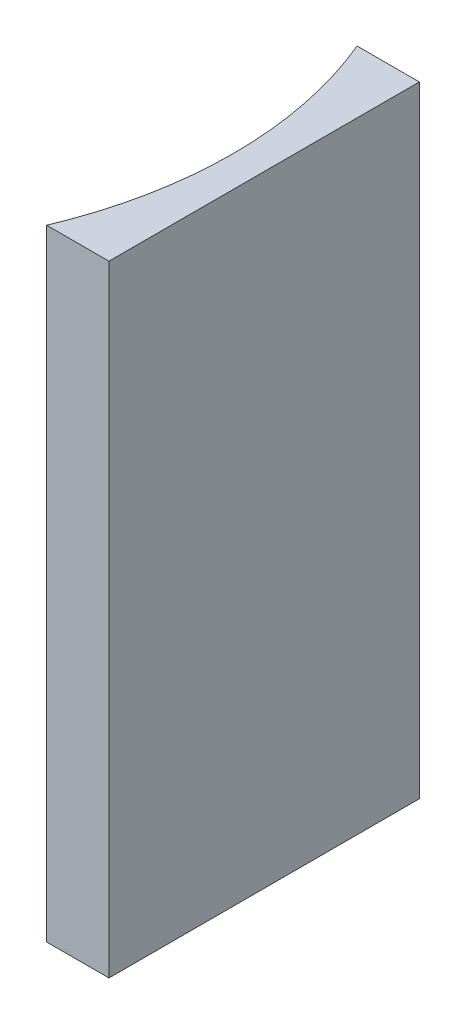
ISO-10303-21;
HEADER;
FILE_DESCRIPTION(('STEP AP214'),'2;1');
FILE_NAME('part.step','',(''),(''),'','','');
FILE_SCHEMA(('AUTOMOTIVE_DESIGN { 1 0 10303 214 1 1 1 1 }'));
ENDSEC;
DATA;
#1=APPLICATION_CONTEXT('core data for automotive mechanical design processes');
#2=APPLICATION_PROTOCOL_DEFINITION('international standard','automotive_design',2000,#1);
#3=PRODUCT_CONTEXT('',#1,'mechanical');
#4=PRODUCT('Part','Part','',(#3));
#5=PRODUCT_RELATED_PRODUCT_CATEGORY('part','',(#4));
#6=PRODUCT_DEFINITION_FORMATION('','',#4);
#7=PRODUCT_DEFINITION_CONTEXT('part definition',#1,'design');
#8=PRODUCT_DEFINITION('design','',#6,#7);
#9=PRODUCT_DEFINITION_SHAPE('','',#8);
#10=(LENGTH_UNIT() NAMED_UNIT(*) SI_UNIT(.MILLI.,.METRE.));
#11=(NAMED_UNIT(*) PLANE_ANGLE_UNIT() SI_UNIT($,.RADIAN.));
#12=(NAMED_UNIT(*) SI_UNIT($,.STERADIAN.) SOLID_ANGLE_UNIT());
#13=UNCERTAINTY_MEASURE_WITH_UNIT(LENGTH_MEASURE(1.E-05),#10,'distance_accuracy_value','');
#14=(GEOMETRIC_REPRESENTATION_CONTEXT(3) GLOBAL_UNCERTAINTY_ASSIGNED_CONTEXT((#13)) GLOBAL_UNIT_ASSIGNED_CONTEXT((#10,
#11,#12)) REPRESENTATION_CONTEXT('',''));
#15=CARTESIAN_POINT('',(0.,0.,0.));
#16=DIRECTION('',(0.,0.,1.));
#17=DIRECTION('',(1.,0.,0.));
#18=AXIS2_PLACEMENT_3D('',#15,#16,#17);
#19=CARTESIAN_POINT('',(0.,40.,0.));
#20=DIRECTION('',(0.,0.,1.));
#21=DIRECTION('',(1.,0.,0.));
#22=AXIS2_PLACEMENT_3D('',#19,#20,#21);
#23=PLANE('',#22);
#24=DIRECTION('',(-1.,0.,0.));
#25=VECTOR('',#24,1.);
#26=CARTESIAN_POINT('',(0.,0.,0.));
#27=LINE('',#26,#25);
#28=CARTESIAN_POINT('',(0.,0.,0.));
#29=VERTEX_POINT('',#28);
#30=CARTESIAN_POINT('',(-4.01258193511721,0.,0.));
#31=VERTEX_POINT('',#30);
#32=EDGE_CURVE('E100',#29,#31,#27,.T.);
#33=ORIENTED_EDGE('',*,*,#32,.T.);
#34=DIRECTION('',(0.,-1.,0.));
#35=VECTOR('',#34,1.);
#36=CARTESIAN_POINT('',(-4.01258193511721,40.,0.));
#37=LINE('',#36,#35);
#38=CARTESIAN_POINT('',(-4.01258193511721,40.,0.));
#39=VERTEX_POINT('',#38);
#40=EDGE_CURVE('E11',#39,#31,#37,.T.);
#41=ORIENTED_EDGE('',*,*,#40,.F.);
#42=DIRECTION('',(-1.,0.,0.));
#43=VECTOR('',#42,1.);
#44=CARTESIAN_POINT('',(0.,40.,0.));
#45=LINE('',#44,#43);
#46=CARTESIAN_POINT('',(0.,40.,0.));
#47=VERTEX_POINT('',#46);
#48=EDGE_CURVE('E88',#47,#39,#45,.T.);
#49=ORIENTED_EDGE('',*,*,#48,.F.);
#50=DIRECTION('',(0.,-1.,0.));
#51=VECTOR('',#50,1.);
#52=CARTESIAN_POINT('',(0.,40.,0.));
#53=LINE('',#52,#51);
#54=EDGE_CURVE('E96',#47,#29,#53,.T.);
#55=ORIENTED_EDGE('',*,*,#54,.T.);
#56=EDGE_LOOP('',(#33,#41,#49,#55));
#57=FACE_BOUND('',#56,.T.);
#58=ADVANCED_FACE('F37',(#57),#23,.F.);
#59=CARTESIAN_POINT('',(-27.85,40.,10.));
#60=DIRECTION('',(0.,-1.,0.));
#61=DIRECTION('',(0.,0.,-1.));
#62=AXIS2_PLACEMENT_3D('',#59,#60,#61);
#63=CYLINDRICAL_SURFACE('',#62,25.85);
#64=CARTESIAN_POINT('',(-27.85,0.,10.));
#65=DIRECTION('',(0.,-1.,0.));
#66=DIRECTION('',(0.,0.,1.));
#67=AXIS2_PLACEMENT_3D('',#64,#65,#66);
#68=CIRCLE('',#67,25.85);
#69=CARTESIAN_POINT('',(-4.01258193511721,0.,20.));
#70=VERTEX_POINT('',#69);
#71=EDGE_CURVE('E92',#31,#70,#68,.T.);
#72=ORIENTED_EDGE('',*,*,#71,.T.);
#73=DIRECTION('',(0.,-1.,0.));
#74=VECTOR('',#73,1.);
#75=CARTESIAN_POINT('',(-4.01258193511721,40.,20.));
#76=LINE('',#75,#74);
#77=CARTESIAN_POINT('',(-4.01258193511721,40.,20.));
#78=VERTEX_POINT('',#77);
#79=EDGE_CURVE('E45',#78,#70,#76,.T.);
#80=ORIENTED_EDGE('',*,*,#79,.F.);
#81=CARTESIAN_POINT('',(-27.85,40.,10.));
#82=DIRECTION('',(0.,-1.,0.));
#83=DIRECTION('',(0.,0.,1.));
#84=AXIS2_PLACEMENT_3D('',#81,#82,#83);
#85=CIRCLE('',#84,25.85);
#86=EDGE_CURVE('E83',#39,#78,#85,.T.);
#87=ORIENTED_EDGE('',*,*,#86,.F.);
#88=ORIENTED_EDGE('',*,*,#40,.T.);
#89=EDGE_LOOP('',(#72,#80,#87,#88));
#90=FACE_BOUND('',#89,.T.);
#91=ADVANCED_FACE('F91',(#90),#63,.F.);
#92=CARTESIAN_POINT('',(0.,40.,20.));
#93=DIRECTION('',(0.,0.,-1.));
#94=DIRECTION('',(-1.,0.,0.));
#95=AXIS2_PLACEMENT_3D('',#92,#93,#94);
#96=PLANE('',#95);
#97=DIRECTION('',(1.,0.,0.));
#98=VECTOR('',#97,1.);
#99=CARTESIAN_POINT('',(0.,0.,20.));
#100=LINE('',#99,#98);
#101=CARTESIAN_POINT('',(0.,0.,20.));
#102=VERTEX_POINT('',#101);
#103=EDGE_CURVE('E70',#70,#102,#100,.T.);
#104=ORIENTED_EDGE('',*,*,#103,.T.);
#105=DIRECTION('',(0.,-1.,0.));
#106=VECTOR('',#105,1.);
#107=CARTESIAN_POINT('',(0.,40.,20.));
#108=LINE('',#107,#106);
#109=CARTESIAN_POINT('',(0.,40.,20.));
#110=VERTEX_POINT('',#109);
#111=EDGE_CURVE('E93',#110,#102,#108,.T.);
#112=ORIENTED_EDGE('',*,*,#111,.F.);
#113=DIRECTION('',(1.,0.,0.));
#114=VECTOR('',#113,1.);
#115=CARTESIAN_POINT('',(0.,40.,20.));
#116=LINE('',#115,#114);
#117=EDGE_CURVE('E86',#78,#110,#116,.T.);
#118=ORIENTED_EDGE('',*,*,#117,.F.);
#119=ORIENTED_EDGE('',*,*,#79,.T.);
#120=EDGE_LOOP('',(#104,#112,#118,#119));
#121=FACE_BOUND('',#120,.T.);
#122=ADVANCED_FACE('F94',(#121),#96,.F.);
#123=CARTESIAN_POINT('',(0.,40.,0.));
#124=DIRECTION('',(-1.,0.,0.));
#125=DIRECTION('',(0.,0.,1.));
#126=AXIS2_PLACEMENT_3D('',#123,#124,#125);
#127=PLANE('',#126);
#128=DIRECTION('',(0.,0.,-1.));
#129=VECTOR('',#128,1.);
#130=CARTESIAN_POINT('',(0.,0.,0.));
#131=LINE('',#130,#129);
#132=EDGE_CURVE('E76',#102,#29,#131,.T.);
#133=ORIENTED_EDGE('',*,*,#132,.T.);
#134=ORIENTED_EDGE('',*,*,#54,.F.);
#135=DIRECTION('',(0.,0.,-1.));
#136=VECTOR('',#135,1.);
#137=CARTESIAN_POINT('',(0.,40.,0.));
#138=LINE('',#137,#136);
#139=EDGE_CURVE('E53',#110,#47,#138,.T.);
#140=ORIENTED_EDGE('',*,*,#139,.F.);
#141=ORIENTED_EDGE('',*,*,#111,.T.);
#142=EDGE_LOOP('',(#133,#134,#140,#141));
#143=FACE_BOUND('',#142,.T.);
#144=ADVANCED_FACE('F107',(#143),#127,.F.);
#145=CARTESIAN_POINT('',(-27.85,40.,10.));
#146=DIRECTION('',(0.,1.,0.));
#147=DIRECTION('',(0.,0.,1.));
#148=AXIS2_PLACEMENT_3D('',#145,#146,#147);
#149=PLANE('',#148);
#150=ORIENTED_EDGE('',*,*,#48,.T.);
#151=ORIENTED_EDGE('',*,*,#86,.T.);
#152=ORIENTED_EDGE('',*,*,#117,.T.);
#153=ORIENTED_EDGE('',*,*,#139,.T.);
#154=EDGE_LOOP('',(#150,#151,#152,#153));
#155=FACE_BOUND('',#154,.T.);
#156=ADVANCED_FACE('F84',(#155),#149,.T.);
#157=CARTESIAN_POINT('',(-27.85,0.,10.));
#158=DIRECTION('',(0.,1.,0.));
#159=DIRECTION('',(0.,0.,1.));
#160=AXIS2_PLACEMENT_3D('',#157,#158,#159);
#161=PLANE('',#160);
#162=ORIENTED_EDGE('',*,*,#32,.F.);
#163=ORIENTED_EDGE('',*,*,#132,.F.);
#164=ORIENTED_EDGE('',*,*,#103,.F.);
#165=ORIENTED_EDGE('',*,*,#71,.F.);
#166=EDGE_LOOP('',(#162,#163,#164,#165));
#167=FACE_BOUND('',#166,.T.);
#168=ADVANCED_FACE('F110',(#167),#161,.F.);
#169=CLOSED_SHELL('',(#58,#91,#122,#144,#156,#168));
#170=MANIFOLD_SOLID_BREP('B2',#169);
#171=ADVANCED_BREP_SHAPE_REPRESENTATION('',(#18,#170),#14);
#172=SHAPE_DEFINITION_REPRESENTATION(#9,#171);
ENDSEC;
END-ISO-10303-21;
